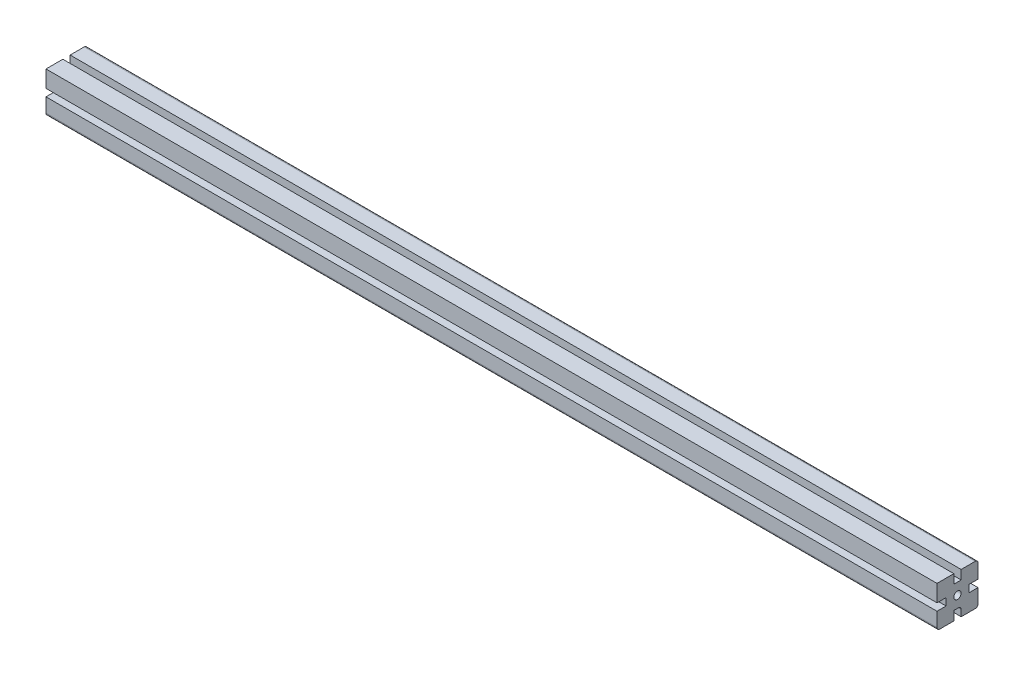
ISO-10303-21;
HEADER;
FILE_DESCRIPTION(('STEP AP214'),'2;1');
FILE_NAME('part.step','',(''),(''),'','','');
FILE_SCHEMA(('AUTOMOTIVE_DESIGN { 1 0 10303 214 1 1 1 1 }'));
ENDSEC;
DATA;
#1=APPLICATION_CONTEXT('core data for automotive mechanical design processes');
#2=APPLICATION_PROTOCOL_DEFINITION('international standard','automotive_design',2000,#1);
#3=PRODUCT_CONTEXT('',#1,'mechanical');
#4=PRODUCT('Part','Part','',(#3));
#5=PRODUCT_RELATED_PRODUCT_CATEGORY('part','',(#4));
#6=PRODUCT_DEFINITION_FORMATION('','',#4);
#7=PRODUCT_DEFINITION_CONTEXT('part definition',#1,'design');
#8=PRODUCT_DEFINITION('design','',#6,#7);
#9=PRODUCT_DEFINITION_SHAPE('','',#8);
#10=(LENGTH_UNIT() NAMED_UNIT(*) SI_UNIT(.MILLI.,.METRE.));
#11=(NAMED_UNIT(*) PLANE_ANGLE_UNIT() SI_UNIT($,.RADIAN.));
#12=(NAMED_UNIT(*) SI_UNIT($,.STERADIAN.) SOLID_ANGLE_UNIT());
#13=UNCERTAINTY_MEASURE_WITH_UNIT(LENGTH_MEASURE(1.E-05),#10,'distance_accuracy_value','');
#14=(GEOMETRIC_REPRESENTATION_CONTEXT(3) GLOBAL_UNCERTAINTY_ASSIGNED_CONTEXT((#13)) GLOBAL_UNIT_ASSIGNED_CONTEXT((#10,
#11,#12)) REPRESENTATION_CONTEXT('',''));
#15=CARTESIAN_POINT('',(0.,0.,0.));
#16=DIRECTION('',(0.,0.,1.));
#17=DIRECTION('',(1.,0.,0.));
#18=AXIS2_PLACEMENT_3D('',#15,#16,#17);
#19=CARTESIAN_POINT('',(22.,-22.5,-22.5));
#20=DIRECTION('',(0.,0.,-1.));
#21=DIRECTION('',(0.,1.,0.));
#22=AXIS2_PLACEMENT_3D('',#19,#20,#21);
#23=PLANE('',#22);
#24=DIRECTION('',(0.,1.,0.));
#25=VECTOR('',#24,1.);
#26=CARTESIAN_POINT('',(1000.,-22.5,-22.5));
#27=LINE('',#26,#25);
#28=CARTESIAN_POINT('',(1000.,-19.5,-22.5));
#29=VERTEX_POINT('',#28);
#30=CARTESIAN_POINT('',(1000.,-4.,-22.5));
#31=VERTEX_POINT('',#30);
#32=EDGE_CURVE('E269',#29,#31,#27,.T.);
#33=ORIENTED_EDGE('',*,*,#32,.F.);
#34=DIRECTION('',(1.,0.,0.));
#35=VECTOR('',#34,1.);
#36=CARTESIAN_POINT('',(22.,-19.5,-22.5));
#37=LINE('',#36,#35);
#38=CARTESIAN_POINT('',(22.,-19.5,-22.5));
#39=VERTEX_POINT('',#38);
#40=EDGE_CURVE('E200',#29,#39,#37,.F.);
#41=ORIENTED_EDGE('',*,*,#40,.T.);
#42=DIRECTION('',(0.,1.,0.));
#43=VECTOR('',#42,1.);
#44=CARTESIAN_POINT('',(22.,-22.5,-22.5));
#45=LINE('',#44,#43);
#46=CARTESIAN_POINT('',(22.,-4.,-22.5));
#47=VERTEX_POINT('',#46);
#48=EDGE_CURVE('E194',#39,#47,#45,.T.);
#49=ORIENTED_EDGE('',*,*,#48,.T.);
#50=DIRECTION('',(1.,0.,0.));
#51=VECTOR('',#50,1.);
#52=CARTESIAN_POINT('',(22.,-4.,-22.5));
#53=LINE('',#52,#51);
#54=EDGE_CURVE('E197',#47,#31,#53,.T.);
#55=ORIENTED_EDGE('',*,*,#54,.T.);
#56=EDGE_LOOP('',(#33,#41,#49,#55));
#57=FACE_BOUND('',#56,.T.);
#58=ADVANCED_FACE('F32',(#57),#23,.T.);
#59=CARTESIAN_POINT('',(22.,-22.5,-4.00000000000001));
#60=DIRECTION('',(0.,-1.,0.));
#61=DIRECTION('',(0.,0.,-1.));
#62=AXIS2_PLACEMENT_3D('',#59,#60,#61);
#63=PLANE('',#62);
#64=DIRECTION('',(0.,0.,-1.));
#65=VECTOR('',#64,1.);
#66=CARTESIAN_POINT('',(22.,-22.5,-4.00000000000001));
#67=LINE('',#66,#65);
#68=CARTESIAN_POINT('',(22.,-22.5,-4.00000000000001));
#69=VERTEX_POINT('',#68);
#70=CARTESIAN_POINT('',(22.,-22.5,-19.5));
#71=VERTEX_POINT('',#70);
#72=EDGE_CURVE('E212',#69,#71,#67,.T.);
#73=ORIENTED_EDGE('',*,*,#72,.T.);
#74=DIRECTION('',(1.,0.,0.));
#75=VECTOR('',#74,1.);
#76=CARTESIAN_POINT('',(22.,-22.5,-19.5));
#77=LINE('',#76,#75);
#78=CARTESIAN_POINT('',(1000.,-22.5,-19.5));
#79=VERTEX_POINT('',#78);
#80=EDGE_CURVE('E326',#71,#79,#77,.T.);
#81=ORIENTED_EDGE('',*,*,#80,.T.);
#82=DIRECTION('',(0.,0.,-1.));
#83=VECTOR('',#82,1.);
#84=CARTESIAN_POINT('',(1000.,-22.5,-4.00000000000001));
#85=LINE('',#84,#83);
#86=CARTESIAN_POINT('',(1000.,-22.5,-4.00000000000001));
#87=VERTEX_POINT('',#86);
#88=EDGE_CURVE('E204',#87,#79,#85,.T.);
#89=ORIENTED_EDGE('',*,*,#88,.F.);
#90=DIRECTION('',(1.,0.,0.));
#91=VECTOR('',#90,1.);
#92=CARTESIAN_POINT('',(22.,-22.5,-4.00000000000001));
#93=LINE('',#92,#91);
#94=EDGE_CURVE('E323',#69,#87,#93,.T.);
#95=ORIENTED_EDGE('',*,*,#94,.F.);
#96=EDGE_LOOP('',(#73,#81,#89,#95));
#97=FACE_BOUND('',#96,.T.);
#98=ADVANCED_FACE('F467',(#97),#63,.T.);
#99=CARTESIAN_POINT('',(22.,-12.5,-4.));
#100=DIRECTION('',(0.,0.,1.));
#101=DIRECTION('',(0.,-1.,0.));
#102=AXIS2_PLACEMENT_3D('',#99,#100,#101);
#103=PLANE('',#102);
#104=DIRECTION('',(0.,-1.,0.));
#105=VECTOR('',#104,1.);
#106=CARTESIAN_POINT('',(1000.,-12.5,-4.));
#107=LINE('',#106,#105);
#108=CARTESIAN_POINT('',(1000.,-15.5,-4.));
#109=VERTEX_POINT('',#108);
#110=EDGE_CURVE('E319',#109,#87,#107,.T.);
#111=ORIENTED_EDGE('',*,*,#110,.F.);
#112=DIRECTION('',(1.,0.,0.));
#113=VECTOR('',#112,1.);
#114=CARTESIAN_POINT('',(22.,-15.5,-4.));
#115=LINE('',#114,#113);
#116=CARTESIAN_POINT('',(22.,-15.5,-4.));
#117=VERTEX_POINT('',#116);
#118=EDGE_CURVE('E382',#109,#117,#115,.F.);
#119=ORIENTED_EDGE('',*,*,#118,.T.);
#120=DIRECTION('',(0.,-1.,0.));
#121=VECTOR('',#120,1.);
#122=CARTESIAN_POINT('',(22.,-12.5,-4.));
#123=LINE('',#122,#121);
#124=EDGE_CURVE('E265',#117,#69,#123,.T.);
#125=ORIENTED_EDGE('',*,*,#124,.T.);
#126=ORIENTED_EDGE('',*,*,#94,.T.);
#127=EDGE_LOOP('',(#111,#119,#125,#126));
#128=FACE_BOUND('',#127,.T.);
#129=ADVANCED_FACE('F391',(#128),#103,.T.);
#130=CARTESIAN_POINT('',(22.,-12.5,4.));
#131=DIRECTION('',(0.,-1.,0.));
#132=DIRECTION('',(0.,0.,-1.));
#133=AXIS2_PLACEMENT_3D('',#130,#131,#132);
#134=PLANE('',#133);
#135=DIRECTION('',(0.,0.,-1.));
#136=VECTOR('',#135,1.);
#137=CARTESIAN_POINT('',(22.,-12.5,4.));
#138=LINE('',#137,#136);
#139=CARTESIAN_POINT('',(22.,-12.5,4.));
#140=VERTEX_POINT('',#139);
#141=CARTESIAN_POINT('',(22.,-12.5,-1.));
#142=VERTEX_POINT('',#141);
#143=EDGE_CURVE('E262',#140,#142,#138,.T.);
#144=ORIENTED_EDGE('',*,*,#143,.T.);
#145=DIRECTION('',(1.,0.,0.));
#146=VECTOR('',#145,1.);
#147=CARTESIAN_POINT('',(1000.,-12.5,-1.));
#148=LINE('',#147,#146);
#149=CARTESIAN_POINT('',(1000.,-12.5,-1.));
#150=VERTEX_POINT('',#149);
#151=EDGE_CURVE('E379',#142,#150,#148,.T.);
#152=ORIENTED_EDGE('',*,*,#151,.T.);
#153=DIRECTION('',(0.,0.,-1.));
#154=VECTOR('',#153,1.);
#155=CARTESIAN_POINT('',(1000.,-12.5,4.));
#156=LINE('',#155,#154);
#157=CARTESIAN_POINT('',(1000.,-12.5,4.));
#158=VERTEX_POINT('',#157);
#159=EDGE_CURVE('E316',#158,#150,#156,.T.);
#160=ORIENTED_EDGE('',*,*,#159,.F.);
#161=DIRECTION('',(1.,0.,0.));
#162=VECTOR('',#161,1.);
#163=CARTESIAN_POINT('',(22.,-12.5,4.));
#164=LINE('',#163,#162);
#165=EDGE_CURVE('E327',#140,#158,#164,.T.);
#166=ORIENTED_EDGE('',*,*,#165,.F.);
#167=EDGE_LOOP('',(#144,#152,#160,#166));
#168=FACE_BOUND('',#167,.T.);
#169=ADVANCED_FACE('F400',(#168),#134,.T.);
#170=CARTESIAN_POINT('',(22.,-22.5,4.00000000000001));
#171=DIRECTION('',(0.,0.,-1.));
#172=DIRECTION('',(0.,1.,0.));
#173=AXIS2_PLACEMENT_3D('',#170,#171,#172);
#174=PLANE('',#173);
#175=DIRECTION('',(0.,1.,0.));
#176=VECTOR('',#175,1.);
#177=CARTESIAN_POINT('',(1000.,-22.5,4.00000000000001));
#178=LINE('',#177,#176);
#179=CARTESIAN_POINT('',(1000.,-22.5,4.00000000000001));
#180=VERTEX_POINT('',#179);
#181=EDGE_CURVE('E313',#180,#158,#178,.T.);
#182=ORIENTED_EDGE('',*,*,#181,.F.);
#183=DIRECTION('',(1.,0.,0.));
#184=VECTOR('',#183,1.);
#185=CARTESIAN_POINT('',(22.,-22.5,4.00000000000001));
#186=LINE('',#185,#184);
#187=CARTESIAN_POINT('',(22.,-22.5,4.00000000000001));
#188=VERTEX_POINT('',#187);
#189=EDGE_CURVE('E329',#188,#180,#186,.T.);
#190=ORIENTED_EDGE('',*,*,#189,.F.);
#191=DIRECTION('',(0.,1.,0.));
#192=VECTOR('',#191,1.);
#193=CARTESIAN_POINT('',(22.,-22.5,4.00000000000001));
#194=LINE('',#193,#192);
#195=EDGE_CURVE('E259',#188,#140,#194,.T.);
#196=ORIENTED_EDGE('',*,*,#195,.T.);
#197=ORIENTED_EDGE('',*,*,#165,.T.);
#198=EDGE_LOOP('',(#182,#190,#196,#197));
#199=FACE_BOUND('',#198,.T.);
#200=ADVANCED_FACE('F403',(#199),#174,.T.);
#201=CARTESIAN_POINT('',(22.,-22.5,22.5));
#202=DIRECTION('',(0.,-1.,0.));
#203=DIRECTION('',(0.,0.,-1.));
#204=AXIS2_PLACEMENT_3D('',#201,#202,#203);
#205=PLANE('',#204);
#206=DIRECTION('',(0.,0.,-1.));
#207=VECTOR('',#206,1.);
#208=CARTESIAN_POINT('',(1000.,-22.5,22.5));
#209=LINE('',#208,#207);
#210=CARTESIAN_POINT('',(1000.,-22.5,19.5));
#211=VERTEX_POINT('',#210);
#212=EDGE_CURVE('E311',#211,#180,#209,.T.);
#213=ORIENTED_EDGE('',*,*,#212,.F.);
#214=DIRECTION('',(1.,0.,0.));
#215=VECTOR('',#214,1.);
#216=CARTESIAN_POINT('',(22.,-22.5,19.5));
#217=LINE('',#216,#215);
#218=CARTESIAN_POINT('',(22.,-22.5,19.5));
#219=VERTEX_POINT('',#218);
#220=EDGE_CURVE('E373',#211,#219,#217,.F.);
#221=ORIENTED_EDGE('',*,*,#220,.T.);
#222=DIRECTION('',(0.,0.,-1.));
#223=VECTOR('',#222,1.);
#224=CARTESIAN_POINT('',(22.,-22.5,22.5));
#225=LINE('',#224,#223);
#226=EDGE_CURVE('E257',#219,#188,#225,.T.);
#227=ORIENTED_EDGE('',*,*,#226,.T.);
#228=ORIENTED_EDGE('',*,*,#189,.T.);
#229=EDGE_LOOP('',(#213,#221,#227,#228));
#230=FACE_BOUND('',#229,.T.);
#231=ADVANCED_FACE('F483',(#230),#205,.T.);
#232=CARTESIAN_POINT('',(22.,-4.,22.5));
#233=DIRECTION('',(0.,0.,1.));
#234=DIRECTION('',(0.,-1.,0.));
#235=AXIS2_PLACEMENT_3D('',#232,#233,#234);
#236=PLANE('',#235);
#237=DIRECTION('',(0.,-1.,0.));
#238=VECTOR('',#237,1.);
#239=CARTESIAN_POINT('',(22.,-4.,22.5));
#240=LINE('',#239,#238);
#241=CARTESIAN_POINT('',(22.,-4.,22.5));
#242=VERTEX_POINT('',#241);
#243=CARTESIAN_POINT('',(22.,-19.5,22.5));
#244=VERTEX_POINT('',#243);
#245=EDGE_CURVE('E254',#242,#244,#240,.T.);
#246=ORIENTED_EDGE('',*,*,#245,.T.);
#247=DIRECTION('',(1.,0.,0.));
#248=VECTOR('',#247,1.);
#249=CARTESIAN_POINT('',(22.,-19.5,22.5));
#250=LINE('',#249,#248);
#251=CARTESIAN_POINT('',(1000.,-19.5,22.5));
#252=VERTEX_POINT('',#251);
#253=EDGE_CURVE('E370',#244,#252,#250,.T.);
#254=ORIENTED_EDGE('',*,*,#253,.T.);
#255=DIRECTION('',(0.,-1.,0.));
#256=VECTOR('',#255,1.);
#257=CARTESIAN_POINT('',(1000.,-4.,22.5));
#258=LINE('',#257,#256);
#259=CARTESIAN_POINT('',(1000.,-4.,22.5));
#260=VERTEX_POINT('',#259);
#261=EDGE_CURVE('E308',#260,#252,#258,.T.);
#262=ORIENTED_EDGE('',*,*,#261,.F.);
#263=DIRECTION('',(1.,0.,0.));
#264=VECTOR('',#263,1.);
#265=CARTESIAN_POINT('',(22.,-4.,22.5));
#266=LINE('',#265,#264);
#267=EDGE_CURVE('E332',#242,#260,#266,.T.);
#268=ORIENTED_EDGE('',*,*,#267,.F.);
#269=EDGE_LOOP('',(#246,#254,#262,#268));
#270=FACE_BOUND('',#269,.T.);
#271=ADVANCED_FACE('F415',(#270),#236,.T.);
#272=CARTESIAN_POINT('',(22.,-4.,12.5));
#273=DIRECTION('',(0.,1.,0.));
#274=DIRECTION('',(0.,0.,1.));
#275=AXIS2_PLACEMENT_3D('',#272,#273,#274);
#276=PLANE('',#275);
#277=DIRECTION('',(0.,0.,1.));
#278=VECTOR('',#277,1.);
#279=CARTESIAN_POINT('',(1000.,-4.,12.5));
#280=LINE('',#279,#278);
#281=CARTESIAN_POINT('',(1000.,-4.,12.5));
#282=VERTEX_POINT('',#281);
#283=EDGE_CURVE('E305',#282,#260,#280,.T.);
#284=ORIENTED_EDGE('',*,*,#283,.F.);
#285=DIRECTION('',(1.,0.,0.));
#286=VECTOR('',#285,1.);
#287=CARTESIAN_POINT('',(22.,-4.,12.5));
#288=LINE('',#287,#286);
#289=CARTESIAN_POINT('',(22.,-4.,12.5));
#290=VERTEX_POINT('',#289);
#291=EDGE_CURVE('E334',#290,#282,#288,.T.);
#292=ORIENTED_EDGE('',*,*,#291,.F.);
#293=DIRECTION('',(0.,0.,1.));
#294=VECTOR('',#293,1.);
#295=CARTESIAN_POINT('',(22.,-4.,12.5));
#296=LINE('',#295,#294);
#297=EDGE_CURVE('E251',#290,#242,#296,.T.);
#298=ORIENTED_EDGE('',*,*,#297,.T.);
#299=ORIENTED_EDGE('',*,*,#267,.T.);
#300=EDGE_LOOP('',(#284,#292,#298,#299));
#301=FACE_BOUND('',#300,.T.);
#302=ADVANCED_FACE('F420',(#301),#276,.T.);
#303=CARTESIAN_POINT('',(22.,4.,12.5));
#304=DIRECTION('',(0.,0.,1.));
#305=DIRECTION('',(1.,0.,0.));
#306=AXIS2_PLACEMENT_3D('',#303,#304,#305);
#307=PLANE('',#306);
#308=DIRECTION('',(0.,-1.,0.));
#309=VECTOR('',#308,1.);
#310=CARTESIAN_POINT('',(1000.,4.,12.5));
#311=LINE('',#310,#309);
#312=CARTESIAN_POINT('',(1000.,4.,12.5));
#313=VERTEX_POINT('',#312);
#314=EDGE_CURVE('E302',#313,#282,#311,.T.);
#315=ORIENTED_EDGE('',*,*,#314,.F.);
#316=DIRECTION('',(1.,0.,0.));
#317=VECTOR('',#316,1.);
#318=CARTESIAN_POINT('',(22.,4.,12.5));
#319=LINE('',#318,#317);
#320=CARTESIAN_POINT('',(22.,4.,12.5));
#321=VERTEX_POINT('',#320);
#322=EDGE_CURVE('E336',#321,#313,#319,.T.);
#323=ORIENTED_EDGE('',*,*,#322,.F.);
#324=DIRECTION('',(0.,-1.,0.));
#325=VECTOR('',#324,1.);
#326=CARTESIAN_POINT('',(22.,4.,12.5));
#327=LINE('',#326,#325);
#328=EDGE_CURVE('E248',#321,#290,#327,.T.);
#329=ORIENTED_EDGE('',*,*,#328,.T.);
#330=ORIENTED_EDGE('',*,*,#291,.T.);
#331=EDGE_LOOP('',(#315,#323,#329,#330));
#332=FACE_BOUND('',#331,.T.);
#333=ADVANCED_FACE('F425',(#332),#307,.T.);
#334=CARTESIAN_POINT('',(22.,4.,22.5));
#335=DIRECTION('',(0.,-1.,0.));
#336=DIRECTION('',(0.,0.,-1.));
#337=AXIS2_PLACEMENT_3D('',#334,#335,#336);
#338=PLANE('',#337);
#339=DIRECTION('',(0.,0.,-1.));
#340=VECTOR('',#339,1.);
#341=CARTESIAN_POINT('',(1000.,4.,22.5));
#342=LINE('',#341,#340);
#343=CARTESIAN_POINT('',(1000.,4.,22.5));
#344=VERTEX_POINT('',#343);
#345=EDGE_CURVE('E299',#344,#313,#342,.T.);
#346=ORIENTED_EDGE('',*,*,#345,.F.);
#347=DIRECTION('',(1.,0.,0.));
#348=VECTOR('',#347,1.);
#349=CARTESIAN_POINT('',(22.,4.,22.5));
#350=LINE('',#349,#348);
#351=CARTESIAN_POINT('',(22.,4.,22.5));
#352=VERTEX_POINT('',#351);
#353=EDGE_CURVE('E338',#352,#344,#350,.T.);
#354=ORIENTED_EDGE('',*,*,#353,.F.);
#355=DIRECTION('',(0.,0.,-1.));
#356=VECTOR('',#355,1.);
#357=CARTESIAN_POINT('',(22.,4.,22.5));
#358=LINE('',#357,#356);
#359=EDGE_CURVE('E245',#352,#321,#358,.T.);
#360=ORIENTED_EDGE('',*,*,#359,.T.);
#361=ORIENTED_EDGE('',*,*,#322,.T.);
#362=EDGE_LOOP('',(#346,#354,#360,#361));
#363=FACE_BOUND('',#362,.T.);
#364=ADVANCED_FACE('F428',(#363),#338,.T.);
#365=CARTESIAN_POINT('',(22.,22.5,22.5));
#366=DIRECTION('',(0.,0.,1.));
#367=DIRECTION('',(0.,-1.,0.));
#368=AXIS2_PLACEMENT_3D('',#365,#366,#367);
#369=PLANE('',#368);
#370=DIRECTION('',(0.,-1.,0.));
#371=VECTOR('',#370,1.);
#372=CARTESIAN_POINT('',(1000.,22.5,22.5));
#373=LINE('',#372,#371);
#374=CARTESIAN_POINT('',(1000.,22.5,22.5));
#375=VERTEX_POINT('',#374);
#376=EDGE_CURVE('E296',#375,#344,#373,.T.);
#377=ORIENTED_EDGE('',*,*,#376,.F.);
#378=DIRECTION('',(1.,0.,0.));
#379=VECTOR('',#378,1.);
#380=CARTESIAN_POINT('',(22.,22.5,22.5));
#381=LINE('',#380,#379);
#382=CARTESIAN_POINT('',(22.,22.5,22.5));
#383=VERTEX_POINT('',#382);
#384=EDGE_CURVE('E340',#383,#375,#381,.T.);
#385=ORIENTED_EDGE('',*,*,#384,.F.);
#386=DIRECTION('',(0.,-1.,0.));
#387=VECTOR('',#386,1.);
#388=CARTESIAN_POINT('',(22.,22.5,22.5));
#389=LINE('',#388,#387);
#390=EDGE_CURVE('E242',#383,#352,#389,.T.);
#391=ORIENTED_EDGE('',*,*,#390,.T.);
#392=ORIENTED_EDGE('',*,*,#353,.T.);
#393=EDGE_LOOP('',(#377,#385,#391,#392));
#394=FACE_BOUND('',#393,.T.);
#395=ADVANCED_FACE('F433',(#394),#369,.T.);
#396=CARTESIAN_POINT('',(22.,22.5,4.));
#397=DIRECTION('',(0.,1.,0.));
#398=DIRECTION('',(0.,0.,1.));
#399=AXIS2_PLACEMENT_3D('',#396,#397,#398);
#400=PLANE('',#399);
#401=DIRECTION('',(0.,0.,1.));
#402=VECTOR('',#401,1.);
#403=CARTESIAN_POINT('',(1000.,22.5,4.));
#404=LINE('',#403,#402);
#405=CARTESIAN_POINT('',(1000.,22.5,4.));
#406=VERTEX_POINT('',#405);
#407=EDGE_CURVE('E293',#406,#375,#404,.T.);
#408=ORIENTED_EDGE('',*,*,#407,.F.);
#409=DIRECTION('',(1.,0.,0.));
#410=VECTOR('',#409,1.);
#411=CARTESIAN_POINT('',(22.,22.5,4.));
#412=LINE('',#411,#410);
#413=CARTESIAN_POINT('',(22.,22.5,4.));
#414=VERTEX_POINT('',#413);
#415=EDGE_CURVE('E342',#414,#406,#412,.T.);
#416=ORIENTED_EDGE('',*,*,#415,.F.);
#417=DIRECTION('',(0.,0.,1.));
#418=VECTOR('',#417,1.);
#419=CARTESIAN_POINT('',(22.,22.5,4.));
#420=LINE('',#419,#418);
#421=EDGE_CURVE('E239',#414,#383,#420,.T.);
#422=ORIENTED_EDGE('',*,*,#421,.T.);
#423=ORIENTED_EDGE('',*,*,#384,.T.);
#424=EDGE_LOOP('',(#408,#416,#422,#423));
#425=FACE_BOUND('',#424,.T.);
#426=ADVANCED_FACE('F436',(#425),#400,.T.);
#427=CARTESIAN_POINT('',(22.,12.5,4.));
#428=DIRECTION('',(0.,0.,-1.));
#429=DIRECTION('',(0.,1.,0.));
#430=AXIS2_PLACEMENT_3D('',#427,#428,#429);
#431=PLANE('',#430);
#432=DIRECTION('',(0.,1.,0.));
#433=VECTOR('',#432,1.);
#434=CARTESIAN_POINT('',(1000.,12.5,4.));
#435=LINE('',#434,#433);
#436=CARTESIAN_POINT('',(1000.,12.5,4.));
#437=VERTEX_POINT('',#436);
#438=EDGE_CURVE('E290',#437,#406,#435,.T.);
#439=ORIENTED_EDGE('',*,*,#438,.F.);
#440=DIRECTION('',(1.,0.,0.));
#441=VECTOR('',#440,1.);
#442=CARTESIAN_POINT('',(22.,12.5,4.));
#443=LINE('',#442,#441);
#444=CARTESIAN_POINT('',(22.,12.5,4.));
#445=VERTEX_POINT('',#444);
#446=EDGE_CURVE('E344',#445,#437,#443,.T.);
#447=ORIENTED_EDGE('',*,*,#446,.F.);
#448=DIRECTION('',(0.,1.,0.));
#449=VECTOR('',#448,1.);
#450=CARTESIAN_POINT('',(22.,12.5,4.));
#451=LINE('',#450,#449);
#452=EDGE_CURVE('E236',#445,#414,#451,.T.);
#453=ORIENTED_EDGE('',*,*,#452,.T.);
#454=ORIENTED_EDGE('',*,*,#415,.T.);
#455=EDGE_LOOP('',(#439,#447,#453,#454));
#456=FACE_BOUND('',#455,.T.);
#457=ADVANCED_FACE('F441',(#456),#431,.T.);
#458=CARTESIAN_POINT('',(22.,12.5,-4.));
#459=DIRECTION('',(0.,1.,0.));
#460=DIRECTION('',(0.,0.,1.));
#461=AXIS2_PLACEMENT_3D('',#458,#459,#460);
#462=PLANE('',#461);
#463=DIRECTION('',(0.,0.,1.));
#464=VECTOR('',#463,1.);
#465=CARTESIAN_POINT('',(1000.,12.5,-4.));
#466=LINE('',#465,#464);
#467=CARTESIAN_POINT('',(1000.,12.5,-4.));
#468=VERTEX_POINT('',#467);
#469=EDGE_CURVE('E287',#468,#437,#466,.T.);
#470=ORIENTED_EDGE('',*,*,#469,.F.);
#471=DIRECTION('',(1.,0.,0.));
#472=VECTOR('',#471,1.);
#473=CARTESIAN_POINT('',(22.,12.5,-4.));
#474=LINE('',#473,#472);
#475=CARTESIAN_POINT('',(22.,12.5,-4.));
#476=VERTEX_POINT('',#475);
#477=EDGE_CURVE('E346',#476,#468,#474,.T.);
#478=ORIENTED_EDGE('',*,*,#477,.F.);
#479=DIRECTION('',(0.,0.,1.));
#480=VECTOR('',#479,1.);
#481=CARTESIAN_POINT('',(22.,12.5,-4.));
#482=LINE('',#481,#480);
#483=EDGE_CURVE('E233',#476,#445,#482,.T.);
#484=ORIENTED_EDGE('',*,*,#483,.T.);
#485=ORIENTED_EDGE('',*,*,#446,.T.);
#486=EDGE_LOOP('',(#470,#478,#484,#485));
#487=FACE_BOUND('',#486,.T.);
#488=ADVANCED_FACE('F444',(#487),#462,.T.);
#489=CARTESIAN_POINT('',(22.,22.5,-4.));
#490=DIRECTION('',(0.,0.,1.));
#491=DIRECTION('',(0.,-1.,0.));
#492=AXIS2_PLACEMENT_3D('',#489,#490,#491);
#493=PLANE('',#492);
#494=DIRECTION('',(0.,-1.,0.));
#495=VECTOR('',#494,1.);
#496=CARTESIAN_POINT('',(1000.,22.5,-4.));
#497=LINE('',#496,#495);
#498=CARTESIAN_POINT('',(1000.,22.5,-4.));
#499=VERTEX_POINT('',#498);
#500=EDGE_CURVE('E284',#499,#468,#497,.T.);
#501=ORIENTED_EDGE('',*,*,#500,.F.);
#502=DIRECTION('',(1.,0.,0.));
#503=VECTOR('',#502,1.);
#504=CARTESIAN_POINT('',(22.,22.5,-4.));
#505=LINE('',#504,#503);
#506=CARTESIAN_POINT('',(22.,22.5,-4.));
#507=VERTEX_POINT('',#506);
#508=EDGE_CURVE('E348',#507,#499,#505,.T.);
#509=ORIENTED_EDGE('',*,*,#508,.F.);
#510=DIRECTION('',(0.,-1.,0.));
#511=VECTOR('',#510,1.);
#512=CARTESIAN_POINT('',(22.,22.5,-4.));
#513=LINE('',#512,#511);
#514=EDGE_CURVE('E230',#507,#476,#513,.T.);
#515=ORIENTED_EDGE('',*,*,#514,.T.);
#516=ORIENTED_EDGE('',*,*,#477,.T.);
#517=EDGE_LOOP('',(#501,#509,#515,#516));
#518=FACE_BOUND('',#517,.T.);
#519=ADVANCED_FACE('F449',(#518),#493,.T.);
#520=CARTESIAN_POINT('',(22.,22.5,-22.5));
#521=DIRECTION('',(0.,1.,0.));
#522=DIRECTION('',(0.,0.,1.));
#523=AXIS2_PLACEMENT_3D('',#520,#521,#522);
#524=PLANE('',#523);
#525=DIRECTION('',(0.,0.,1.));
#526=VECTOR('',#525,1.);
#527=CARTESIAN_POINT('',(1000.,22.5,-22.5));
#528=LINE('',#527,#526);
#529=CARTESIAN_POINT('',(1000.,22.5,-19.5));
#530=VERTEX_POINT('',#529);
#531=EDGE_CURVE('E282',#530,#499,#528,.T.);
#532=ORIENTED_EDGE('',*,*,#531,.F.);
#533=DIRECTION('',(1.,0.,0.));
#534=VECTOR('',#533,1.);
#535=CARTESIAN_POINT('',(22.,22.5,-19.5));
#536=LINE('',#535,#534);
#537=CARTESIAN_POINT('',(22.,22.5,-19.5));
#538=VERTEX_POINT('',#537);
#539=EDGE_CURVE('E55',#530,#538,#536,.F.);
#540=ORIENTED_EDGE('',*,*,#539,.T.);
#541=DIRECTION('',(0.,0.,1.));
#542=VECTOR('',#541,1.);
#543=CARTESIAN_POINT('',(22.,22.5,-22.5));
#544=LINE('',#543,#542);
#545=EDGE_CURVE('E228',#538,#507,#544,.T.);
#546=ORIENTED_EDGE('',*,*,#545,.T.);
#547=ORIENTED_EDGE('',*,*,#508,.T.);
#548=EDGE_LOOP('',(#532,#540,#546,#547));
#549=FACE_BOUND('',#548,.T.);
#550=ADVANCED_FACE('F450',(#549),#524,.T.);
#551=CARTESIAN_POINT('',(22.,4.,-22.5));
#552=DIRECTION('',(0.,0.,-1.));
#553=DIRECTION('',(0.,1.,0.));
#554=AXIS2_PLACEMENT_3D('',#551,#552,#553);
#555=PLANE('',#554);
#556=DIRECTION('',(0.,1.,0.));
#557=VECTOR('',#556,1.);
#558=CARTESIAN_POINT('',(22.,4.,-22.5));
#559=LINE('',#558,#557);
#560=CARTESIAN_POINT('',(22.,4.,-22.5));
#561=VERTEX_POINT('',#560);
#562=CARTESIAN_POINT('',(22.,19.5,-22.5));
#563=VERTEX_POINT('',#562);
#564=EDGE_CURVE('E226',#561,#563,#559,.T.);
#565=ORIENTED_EDGE('',*,*,#564,.T.);
#566=DIRECTION('',(1.,0.,0.));
#567=VECTOR('',#566,1.);
#568=CARTESIAN_POINT('',(22.,19.5,-22.5));
#569=LINE('',#568,#567);
#570=CARTESIAN_POINT('',(1000.,19.5,-22.5));
#571=VERTEX_POINT('',#570);
#572=EDGE_CURVE('E375',#563,#571,#569,.T.);
#573=ORIENTED_EDGE('',*,*,#572,.T.);
#574=DIRECTION('',(0.,1.,0.));
#575=VECTOR('',#574,1.);
#576=CARTESIAN_POINT('',(1000.,4.,-22.5));
#577=LINE('',#576,#575);
#578=CARTESIAN_POINT('',(1000.,4.,-22.5));
#579=VERTEX_POINT('',#578);
#580=EDGE_CURVE('E279',#579,#571,#577,.T.);
#581=ORIENTED_EDGE('',*,*,#580,.F.);
#582=DIRECTION('',(1.,0.,0.));
#583=VECTOR('',#582,1.);
#584=CARTESIAN_POINT('',(22.,4.,-22.5));
#585=LINE('',#584,#583);
#586=EDGE_CURVE('E351',#561,#579,#585,.T.);
#587=ORIENTED_EDGE('',*,*,#586,.F.);
#588=EDGE_LOOP('',(#565,#573,#581,#587));
#589=FACE_BOUND('',#588,.T.);
#590=ADVANCED_FACE('F456',(#589),#555,.T.);
#591=CARTESIAN_POINT('',(22.,4.,-12.5));
#592=DIRECTION('',(0.,-1.,0.));
#593=DIRECTION('',(0.,0.,-1.));
#594=AXIS2_PLACEMENT_3D('',#591,#592,#593);
#595=PLANE('',#594);
#596=DIRECTION('',(0.,0.,-1.));
#597=VECTOR('',#596,1.);
#598=CARTESIAN_POINT('',(1000.,4.,-12.5));
#599=LINE('',#598,#597);
#600=CARTESIAN_POINT('',(1000.,4.,-12.5));
#601=VERTEX_POINT('',#600);
#602=EDGE_CURVE('E276',#601,#579,#599,.T.);
#603=ORIENTED_EDGE('',*,*,#602,.F.);
#604=DIRECTION('',(1.,0.,0.));
#605=VECTOR('',#604,1.);
#606=CARTESIAN_POINT('',(22.,4.,-12.5));
#607=LINE('',#606,#605);
#608=CARTESIAN_POINT('',(22.,4.,-12.5));
#609=VERTEX_POINT('',#608);
#610=EDGE_CURVE('E353',#609,#601,#607,.T.);
#611=ORIENTED_EDGE('',*,*,#610,.F.);
#612=DIRECTION('',(0.,0.,-1.));
#613=VECTOR('',#612,1.);
#614=CARTESIAN_POINT('',(22.,4.,-12.5));
#615=LINE('',#614,#613);
#616=EDGE_CURVE('E220',#609,#561,#615,.T.);
#617=ORIENTED_EDGE('',*,*,#616,.T.);
#618=ORIENTED_EDGE('',*,*,#586,.T.);
#619=EDGE_LOOP('',(#603,#611,#617,#618));
#620=FACE_BOUND('',#619,.T.);
#621=ADVANCED_FACE('F460',(#620),#595,.T.);
#622=CARTESIAN_POINT('',(22.,-4.,-12.5));
#623=DIRECTION('',(0.,0.,-1.));
#624=DIRECTION('',(-1.,0.,0.));
#625=AXIS2_PLACEMENT_3D('',#622,#623,#624);
#626=PLANE('',#625);
#627=DIRECTION('',(0.,1.,0.));
#628=VECTOR('',#627,1.);
#629=CARTESIAN_POINT('',(1000.,-4.,-12.5));
#630=LINE('',#629,#628);
#631=CARTESIAN_POINT('',(1000.,-4.,-12.5));
#632=VERTEX_POINT('',#631);
#633=EDGE_CURVE('E273',#632,#601,#630,.T.);
#634=ORIENTED_EDGE('',*,*,#633,.F.);
#635=DIRECTION('',(1.,0.,0.));
#636=VECTOR('',#635,1.);
#637=CARTESIAN_POINT('',(22.,-4.,-12.5));
#638=LINE('',#637,#636);
#639=CARTESIAN_POINT('',(22.,-4.,-12.5));
#640=VERTEX_POINT('',#639);
#641=EDGE_CURVE('E211',#640,#632,#638,.T.);
#642=ORIENTED_EDGE('',*,*,#641,.F.);
#643=DIRECTION('',(0.,1.,0.));
#644=VECTOR('',#643,1.);
#645=CARTESIAN_POINT('',(22.,-4.,-12.5));
#646=LINE('',#645,#644);
#647=EDGE_CURVE('E218',#640,#609,#646,.T.);
#648=ORIENTED_EDGE('',*,*,#647,.T.);
#649=ORIENTED_EDGE('',*,*,#610,.T.);
#650=EDGE_LOOP('',(#634,#642,#648,#649));
#651=FACE_BOUND('',#650,.T.);
#652=ADVANCED_FACE('F462',(#651),#626,.T.);
#653=CARTESIAN_POINT('',(22.,-4.,-22.5));
#654=DIRECTION('',(0.,1.,0.));
#655=DIRECTION('',(0.,0.,1.));
#656=AXIS2_PLACEMENT_3D('',#653,#654,#655);
#657=PLANE('',#656);
#658=DIRECTION('',(0.,0.,1.));
#659=VECTOR('',#658,1.);
#660=CARTESIAN_POINT('',(1000.,-4.,-22.5));
#661=LINE('',#660,#659);
#662=EDGE_CURVE('E210',#31,#632,#661,.T.);
#663=ORIENTED_EDGE('',*,*,#662,.F.);
#664=ORIENTED_EDGE('',*,*,#54,.F.);
#665=DIRECTION('',(0.,0.,1.));
#666=VECTOR('',#665,1.);
#667=CARTESIAN_POINT('',(22.,-4.,-22.5));
#668=LINE('',#667,#666);
#669=EDGE_CURVE('E203',#47,#640,#668,.T.);
#670=ORIENTED_EDGE('',*,*,#669,.T.);
#671=ORIENTED_EDGE('',*,*,#641,.T.);
#672=EDGE_LOOP('',(#663,#664,#670,#671));
#673=FACE_BOUND('',#672,.T.);
#674=ADVANCED_FACE('F208',(#673),#657,.T.);
#675=CARTESIAN_POINT('',(22.,0.,0.));
#676=DIRECTION('',(1.,0.,0.));
#677=DIRECTION('',(0.,0.,-1.));
#678=AXIS2_PLACEMENT_3D('',#675,#676,#677);
#679=PLANE('',#678);
#680=CARTESIAN_POINT('',(22.,0.,0.));
#681=DIRECTION('',(1.,0.,0.));
#682=DIRECTION('',(0.,0.,1.));
#683=AXIS2_PLACEMENT_3D('',#680,#681,#682);
#684=CIRCLE('',#683,4.);
#685=CARTESIAN_POINT('',(22.,0.,4.));
#686=VERTEX_POINT('',#685);
#687=EDGE_CURVE('E271',#686,#686,#684,.T.);
#688=ORIENTED_EDGE('',*,*,#687,.T.);
#689=EDGE_LOOP('',(#688));
#690=FACE_BOUND('',#689,.T.);
#691=ORIENTED_EDGE('',*,*,#48,.F.);
#692=CARTESIAN_POINT('',(22.,-19.5,-19.5));
#693=DIRECTION('',(1.,0.,0.));
#694=DIRECTION('',(0.,0.,-1.));
#695=AXIS2_PLACEMENT_3D('',#692,#693,#694);
#696=CIRCLE('',#695,3.);
#697=EDGE_CURVE('E368',#39,#71,#696,.F.);
#698=ORIENTED_EDGE('',*,*,#697,.T.);
#699=ORIENTED_EDGE('',*,*,#72,.F.);
#700=ORIENTED_EDGE('',*,*,#124,.F.);
#701=CARTESIAN_POINT('',(22.,-15.5,-1.));
#702=DIRECTION('',(1.,0.,0.));
#703=DIRECTION('',(0.,0.,-1.));
#704=AXIS2_PLACEMENT_3D('',#701,#702,#703);
#705=CIRCLE('',#704,3.);
#706=EDGE_CURVE('E11',#117,#142,#705,.T.);
#707=ORIENTED_EDGE('',*,*,#706,.T.);
#708=ORIENTED_EDGE('',*,*,#143,.F.);
#709=ORIENTED_EDGE('',*,*,#195,.F.);
#710=ORIENTED_EDGE('',*,*,#226,.F.);
#711=CARTESIAN_POINT('',(22.,-19.5,19.5));
#712=DIRECTION('',(1.,0.,0.));
#713=DIRECTION('',(0.,0.,-1.));
#714=AXIS2_PLACEMENT_3D('',#711,#712,#713);
#715=CIRCLE('',#714,3.);
#716=EDGE_CURVE('E366',#219,#244,#715,.F.);
#717=ORIENTED_EDGE('',*,*,#716,.T.);
#718=ORIENTED_EDGE('',*,*,#245,.F.);
#719=ORIENTED_EDGE('',*,*,#297,.F.);
#720=ORIENTED_EDGE('',*,*,#328,.F.);
#721=ORIENTED_EDGE('',*,*,#359,.F.);
#722=ORIENTED_EDGE('',*,*,#390,.F.);
#723=ORIENTED_EDGE('',*,*,#421,.F.);
#724=ORIENTED_EDGE('',*,*,#452,.F.);
#725=ORIENTED_EDGE('',*,*,#483,.F.);
#726=ORIENTED_EDGE('',*,*,#514,.F.);
#727=ORIENTED_EDGE('',*,*,#545,.F.);
#728=CARTESIAN_POINT('',(22.,19.5,-19.5));
#729=DIRECTION('',(1.,0.,0.));
#730=DIRECTION('',(0.,0.,-1.));
#731=AXIS2_PLACEMENT_3D('',#728,#729,#730);
#732=CIRCLE('',#731,3.);
#733=EDGE_CURVE('E47',#538,#563,#732,.F.);
#734=ORIENTED_EDGE('',*,*,#733,.T.);
#735=ORIENTED_EDGE('',*,*,#564,.F.);
#736=ORIENTED_EDGE('',*,*,#616,.F.);
#737=ORIENTED_EDGE('',*,*,#647,.F.);
#738=ORIENTED_EDGE('',*,*,#669,.F.);
#739=EDGE_LOOP('',(#691,#698,#699,#700,#707,#708,#709,#710,#717,#718,#719,#720,#721,#722,#723,
#724,#725,#726,#727,#734,#735,#736,#737,#738));
#740=FACE_BOUND('',#739,.T.);
#741=ADVANCED_FACE('F215',(#690,#740),#679,.F.);
#742=CARTESIAN_POINT('',(1000.,0.,0.));
#743=DIRECTION('',(1.,0.,0.));
#744=DIRECTION('',(0.,0.,-1.));
#745=AXIS2_PLACEMENT_3D('',#742,#743,#744);
#746=PLANE('',#745);
#747=CARTESIAN_POINT('',(1000.,0.,0.));
#748=DIRECTION('',(1.,0.,0.));
#749=DIRECTION('',(0.,0.,1.));
#750=AXIS2_PLACEMENT_3D('',#747,#748,#749);
#751=CIRCLE('',#750,4.);
#752=CARTESIAN_POINT('',(1000.,0.,4.));
#753=VERTEX_POINT('',#752);
#754=EDGE_CURVE('E692',#753,#753,#751,.T.);
#755=ORIENTED_EDGE('',*,*,#754,.F.);
#756=EDGE_LOOP('',(#755));
#757=FACE_BOUND('',#756,.T.);
#758=ORIENTED_EDGE('',*,*,#88,.T.);
#759=CARTESIAN_POINT('',(1000.,-19.5,-19.5));
#760=DIRECTION('',(1.,0.,0.));
#761=DIRECTION('',(0.,0.,-1.));
#762=AXIS2_PLACEMENT_3D('',#759,#760,#761);
#763=CIRCLE('',#762,3.);
#764=EDGE_CURVE('E362',#79,#29,#763,.T.);
#765=ORIENTED_EDGE('',*,*,#764,.T.);
#766=ORIENTED_EDGE('',*,*,#32,.T.);
#767=ORIENTED_EDGE('',*,*,#662,.T.);
#768=ORIENTED_EDGE('',*,*,#633,.T.);
#769=ORIENTED_EDGE('',*,*,#602,.T.);
#770=ORIENTED_EDGE('',*,*,#580,.T.);
#771=CARTESIAN_POINT('',(1000.,19.5,-19.5));
#772=DIRECTION('',(1.,0.,0.));
#773=DIRECTION('',(0.,0.,-1.));
#774=AXIS2_PLACEMENT_3D('',#771,#772,#773);
#775=CIRCLE('',#774,3.);
#776=EDGE_CURVE('E358',#571,#530,#775,.T.);
#777=ORIENTED_EDGE('',*,*,#776,.T.);
#778=ORIENTED_EDGE('',*,*,#531,.T.);
#779=ORIENTED_EDGE('',*,*,#500,.T.);
#780=ORIENTED_EDGE('',*,*,#469,.T.);
#781=ORIENTED_EDGE('',*,*,#438,.T.);
#782=ORIENTED_EDGE('',*,*,#407,.T.);
#783=ORIENTED_EDGE('',*,*,#376,.T.);
#784=ORIENTED_EDGE('',*,*,#345,.T.);
#785=ORIENTED_EDGE('',*,*,#314,.T.);
#786=ORIENTED_EDGE('',*,*,#283,.T.);
#787=ORIENTED_EDGE('',*,*,#261,.T.);
#788=CARTESIAN_POINT('',(1000.,-19.5,19.5));
#789=DIRECTION('',(1.,0.,0.));
#790=DIRECTION('',(0.,0.,-1.));
#791=AXIS2_PLACEMENT_3D('',#788,#789,#790);
#792=CIRCLE('',#791,3.);
#793=EDGE_CURVE('E360',#252,#211,#792,.T.);
#794=ORIENTED_EDGE('',*,*,#793,.T.);
#795=ORIENTED_EDGE('',*,*,#212,.T.);
#796=ORIENTED_EDGE('',*,*,#181,.T.);
#797=ORIENTED_EDGE('',*,*,#159,.T.);
#798=CARTESIAN_POINT('',(1000.,-15.5,-1.));
#799=DIRECTION('',(1.,0.,0.));
#800=DIRECTION('',(0.,0.,-1.));
#801=AXIS2_PLACEMENT_3D('',#798,#799,#800);
#802=CIRCLE('',#801,3.);
#803=EDGE_CURVE('E40',#150,#109,#802,.F.);
#804=ORIENTED_EDGE('',*,*,#803,.T.);
#805=ORIENTED_EDGE('',*,*,#110,.T.);
#806=EDGE_LOOP('',(#758,#765,#766,#767,#768,#769,#770,#777,#778,#779,#780,#781,#782,#783,#784,
#785,#786,#787,#794,#795,#796,#797,#804,#805));
#807=FACE_BOUND('',#806,.T.);
#808=ADVANCED_FACE('F385',(#757,#807),#746,.T.);
#809=CARTESIAN_POINT('',(22.,0.,0.));
#810=DIRECTION('',(1.,0.,0.));
#811=DIRECTION('',(0.,0.,-1.));
#812=AXIS2_PLACEMENT_3D('',#809,#810,#811);
#813=CYLINDRICAL_SURFACE('',#812,4.);
#814=ORIENTED_EDGE('',*,*,#687,.F.);
#815=EDGE_LOOP('',(#814));
#816=FACE_BOUND('',#815,.T.);
#817=ORIENTED_EDGE('',*,*,#754,.T.);
#818=EDGE_LOOP('',(#817));
#819=FACE_BOUND('',#818,.T.);
#820=ADVANCED_FACE('F516',(#816,#819),#813,.F.);
#821=CARTESIAN_POINT('',(22.,-19.5,-19.5));
#822=DIRECTION('',(1.,0.,0.));
#823=DIRECTION('',(0.,0.,-1.));
#824=AXIS2_PLACEMENT_3D('',#821,#822,#823);
#825=CYLINDRICAL_SURFACE('',#824,3.);
#826=ORIENTED_EDGE('',*,*,#697,.F.);
#827=ORIENTED_EDGE('',*,*,#40,.F.);
#828=ORIENTED_EDGE('',*,*,#764,.F.);
#829=ORIENTED_EDGE('',*,*,#80,.F.);
#830=EDGE_LOOP('',(#826,#827,#828,#829));
#831=FACE_BOUND('',#830,.T.);
#832=ADVANCED_FACE('F464',(#831),#825,.T.);
#833=CARTESIAN_POINT('',(22.,-19.5,19.5));
#834=DIRECTION('',(1.,0.,0.));
#835=DIRECTION('',(0.,0.,-1.));
#836=AXIS2_PLACEMENT_3D('',#833,#834,#835);
#837=CYLINDRICAL_SURFACE('',#836,3.);
#838=ORIENTED_EDGE('',*,*,#716,.F.);
#839=ORIENTED_EDGE('',*,*,#220,.F.);
#840=ORIENTED_EDGE('',*,*,#793,.F.);
#841=ORIENTED_EDGE('',*,*,#253,.F.);
#842=EDGE_LOOP('',(#838,#839,#840,#841));
#843=FACE_BOUND('',#842,.T.);
#844=ADVANCED_FACE('F412',(#843),#837,.T.);
#845=CARTESIAN_POINT('',(22.,19.5,-19.5));
#846=DIRECTION('',(1.,0.,0.));
#847=DIRECTION('',(0.,0.,-1.));
#848=AXIS2_PLACEMENT_3D('',#845,#846,#847);
#849=CYLINDRICAL_SURFACE('',#848,3.);
#850=ORIENTED_EDGE('',*,*,#733,.F.);
#851=ORIENTED_EDGE('',*,*,#539,.F.);
#852=ORIENTED_EDGE('',*,*,#776,.F.);
#853=ORIENTED_EDGE('',*,*,#572,.F.);
#854=EDGE_LOOP('',(#850,#851,#852,#853));
#855=FACE_BOUND('',#854,.T.);
#856=ADVANCED_FACE('F453',(#855),#849,.T.);
#857=CARTESIAN_POINT('',(22.,-15.5,-1.));
#858=DIRECTION('',(-1.,0.,0.));
#859=DIRECTION('',(0.,0.,1.));
#860=AXIS2_PLACEMENT_3D('',#857,#858,#859);
#861=CYLINDRICAL_SURFACE('',#860,3.);
#862=ORIENTED_EDGE('',*,*,#706,.F.);
#863=ORIENTED_EDGE('',*,*,#118,.F.);
#864=ORIENTED_EDGE('',*,*,#803,.F.);
#865=ORIENTED_EDGE('',*,*,#151,.F.);
#866=EDGE_LOOP('',(#862,#863,#864,#865));
#867=FACE_BOUND('',#866,.T.);
#868=ADVANCED_FACE('F34',(#867),#861,.F.);
#869=CLOSED_SHELL('',(#58,#98,#129,#169,#200,#231,#271,#302,#333,#364,#395,#426,#457,#488,#519,
#550,#590,#621,#652,#674,#741,#808,#820,#832,#844,#856,#868));
#870=MANIFOLD_SOLID_BREP('B2',#869);
#871=ADVANCED_BREP_SHAPE_REPRESENTATION('',(#18,#870),#14);
#872=SHAPE_DEFINITION_REPRESENTATION(#9,#871);
ENDSEC;
END-ISO-10303-21;
